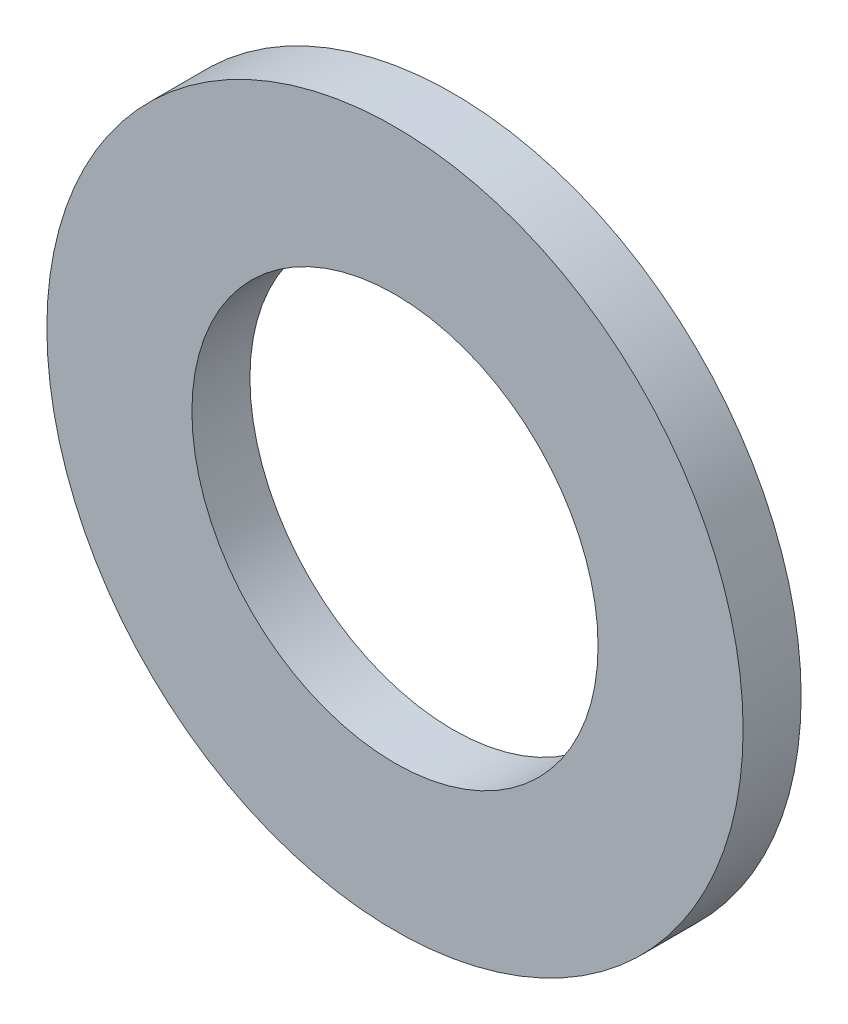
ISO-10303-21;
HEADER;
FILE_DESCRIPTION(('STEP AP214'),'2;1');
FILE_NAME('part.step','',(''),(''),'','','');
FILE_SCHEMA(('AUTOMOTIVE_DESIGN { 1 0 10303 214 1 1 1 1 }'));
ENDSEC;
DATA;
#1=APPLICATION_CONTEXT('core data for automotive mechanical design processes');
#2=APPLICATION_PROTOCOL_DEFINITION('international standard','automotive_design',2000,#1);
#3=PRODUCT_CONTEXT('',#1,'mechanical');
#4=PRODUCT('Part','Part','',(#3));
#5=PRODUCT_RELATED_PRODUCT_CATEGORY('part','',(#4));
#6=PRODUCT_DEFINITION_FORMATION('','',#4);
#7=PRODUCT_DEFINITION_CONTEXT('part definition',#1,'design');
#8=PRODUCT_DEFINITION('design','',#6,#7);
#9=PRODUCT_DEFINITION_SHAPE('','',#8);
#10=(LENGTH_UNIT() NAMED_UNIT(*) SI_UNIT(.MILLI.,.METRE.));
#11=(NAMED_UNIT(*) PLANE_ANGLE_UNIT() SI_UNIT($,.RADIAN.));
#12=(NAMED_UNIT(*) SI_UNIT($,.STERADIAN.) SOLID_ANGLE_UNIT());
#13=UNCERTAINTY_MEASURE_WITH_UNIT(LENGTH_MEASURE(1.E-05),#10,'distance_accuracy_value','');
#14=(GEOMETRIC_REPRESENTATION_CONTEXT(3) GLOBAL_UNCERTAINTY_ASSIGNED_CONTEXT((#13)) GLOBAL_UNIT_ASSIGNED_CONTEXT((#10,
#11,#12)) REPRESENTATION_CONTEXT('',''));
#15=CARTESIAN_POINT('',(0.,0.,0.));
#16=DIRECTION('',(0.,0.,1.));
#17=DIRECTION('',(1.,0.,0.));
#18=AXIS2_PLACEMENT_3D('',#15,#16,#17);
#19=CARTESIAN_POINT('',(0.,0.,2.5));
#20=DIRECTION('',(0.,0.,1.));
#21=DIRECTION('',(1.,0.,0.));
#22=AXIS2_PLACEMENT_3D('',#19,#20,#21);
#23=PLANE('',#22);
#24=CARTESIAN_POINT('',(0.,0.,2.5));
#25=DIRECTION('',(0.,0.,1.));
#26=DIRECTION('',(1.,0.,0.));
#27=AXIS2_PLACEMENT_3D('',#24,#25,#26);
#28=CIRCLE('',#27,15.);
#29=CARTESIAN_POINT('',(15.,0.,2.5));
#30=VERTEX_POINT('',#29);
#31=EDGE_CURVE('E10',#30,#30,#28,.T.);
#32=ORIENTED_EDGE('',*,*,#31,.T.);
#33=EDGE_LOOP('',(#32));
#34=FACE_BOUND('',#33,.T.);
#35=CARTESIAN_POINT('',(0.,0.,2.5));
#36=DIRECTION('',(0.,0.,1.));
#37=DIRECTION('',(1.,0.,0.));
#38=AXIS2_PLACEMENT_3D('',#35,#36,#37);
#39=CIRCLE('',#38,8.75);
#40=CARTESIAN_POINT('',(8.75,0.,2.5));
#41=VERTEX_POINT('',#40);
#42=EDGE_CURVE('E52',#41,#41,#39,.T.);
#43=ORIENTED_EDGE('',*,*,#42,.F.);
#44=EDGE_LOOP('',(#43));
#45=FACE_BOUND('',#44,.T.);
#46=ADVANCED_FACE('F41',(#34,#45),#23,.T.);
#47=CARTESIAN_POINT('',(0.,0.,0.));
#48=DIRECTION('',(0.,0.,1.));
#49=DIRECTION('',(1.,0.,0.));
#50=AXIS2_PLACEMENT_3D('',#47,#48,#49);
#51=PLANE('',#50);
#52=CARTESIAN_POINT('',(0.,0.,0.));
#53=DIRECTION('',(0.,0.,1.));
#54=DIRECTION('',(1.,0.,0.));
#55=AXIS2_PLACEMENT_3D('',#52,#53,#54);
#56=CIRCLE('',#55,15.);
#57=CARTESIAN_POINT('',(15.,0.,0.));
#58=VERTEX_POINT('',#57);
#59=EDGE_CURVE('E45',#58,#58,#56,.T.);
#60=ORIENTED_EDGE('',*,*,#59,.F.);
#61=EDGE_LOOP('',(#60));
#62=FACE_BOUND('',#61,.T.);
#63=CARTESIAN_POINT('',(0.,0.,0.));
#64=DIRECTION('',(0.,0.,1.));
#65=DIRECTION('',(1.,0.,0.));
#66=AXIS2_PLACEMENT_3D('',#63,#64,#65);
#67=CIRCLE('',#66,8.75);
#68=CARTESIAN_POINT('',(8.75,0.,0.));
#69=VERTEX_POINT('',#68);
#70=EDGE_CURVE('E54',#69,#69,#67,.T.);
#71=ORIENTED_EDGE('',*,*,#70,.T.);
#72=EDGE_LOOP('',(#71));
#73=FACE_BOUND('',#72,.T.);
#74=ADVANCED_FACE('F64',(#62,#73),#51,.F.);
#75=CARTESIAN_POINT('',(0.,0.,2.5));
#76=DIRECTION('',(0.,0.,-1.));
#77=DIRECTION('',(-1.,0.,0.));
#78=AXIS2_PLACEMENT_3D('',#75,#76,#77);
#79=CYLINDRICAL_SURFACE('',#78,15.);
#80=ORIENTED_EDGE('',*,*,#31,.F.);
#81=EDGE_LOOP('',(#80));
#82=FACE_BOUND('',#81,.T.);
#83=ORIENTED_EDGE('',*,*,#59,.T.);
#84=EDGE_LOOP('',(#83));
#85=FACE_BOUND('',#84,.T.);
#86=ADVANCED_FACE('F43',(#82,#85),#79,.T.);
#87=CARTESIAN_POINT('',(0.,0.,2.5));
#88=DIRECTION('',(0.,0.,-1.));
#89=DIRECTION('',(-1.,0.,0.));
#90=AXIS2_PLACEMENT_3D('',#87,#88,#89);
#91=CYLINDRICAL_SURFACE('',#90,8.75);
#92=ORIENTED_EDGE('',*,*,#42,.T.);
#93=EDGE_LOOP('',(#92));
#94=FACE_BOUND('',#93,.T.);
#95=ORIENTED_EDGE('',*,*,#70,.F.);
#96=EDGE_LOOP('',(#95));
#97=FACE_BOUND('',#96,.T.);
#98=ADVANCED_FACE('F60',(#94,#97),#91,.F.);
#99=CLOSED_SHELL('',(#46,#74,#86,#98));
#100=MANIFOLD_SOLID_BREP('B2',#99);
#101=ADVANCED_BREP_SHAPE_REPRESENTATION('',(#18,#100),#14);
#102=SHAPE_DEFINITION_REPRESENTATION(#9,#101);
ENDSEC;
END-ISO-10303-21;
